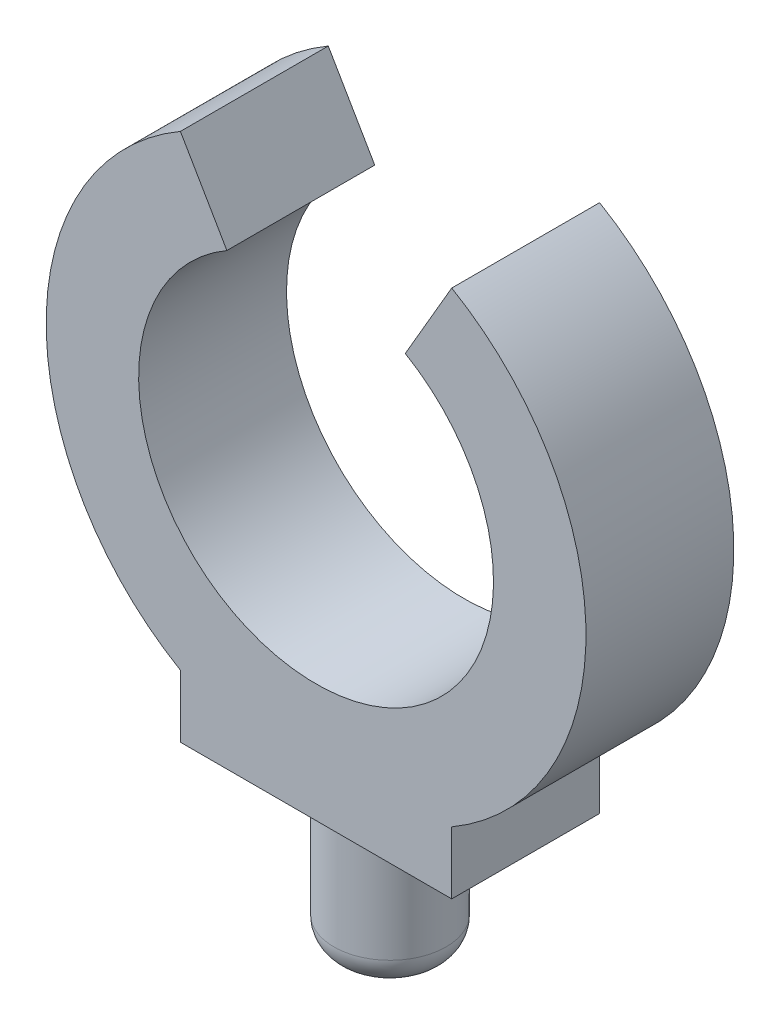
ISO-10303-21;
HEADER;
FILE_DESCRIPTION(('STEP AP214'),'2;1');
FILE_NAME('part.step','',(''),(''),'','','');
FILE_SCHEMA(('AUTOMOTIVE_DESIGN { 1 0 10303 214 1 1 1 1 }'));
ENDSEC;
DATA;
#1=APPLICATION_CONTEXT('core data for automotive mechanical design processes');
#2=APPLICATION_PROTOCOL_DEFINITION('international standard','automotive_design',2000,#1);
#3=PRODUCT_CONTEXT('',#1,'mechanical');
#4=PRODUCT('Part','Part','',(#3));
#5=PRODUCT_RELATED_PRODUCT_CATEGORY('part','',(#4));
#6=PRODUCT_DEFINITION_FORMATION('','',#4);
#7=PRODUCT_DEFINITION_CONTEXT('part definition',#1,'design');
#8=PRODUCT_DEFINITION('design','',#6,#7);
#9=PRODUCT_DEFINITION_SHAPE('','',#8);
#10=(LENGTH_UNIT() NAMED_UNIT(*) SI_UNIT(.MILLI.,.METRE.));
#11=(NAMED_UNIT(*) PLANE_ANGLE_UNIT() SI_UNIT($,.RADIAN.));
#12=(NAMED_UNIT(*) SI_UNIT($,.STERADIAN.) SOLID_ANGLE_UNIT());
#13=UNCERTAINTY_MEASURE_WITH_UNIT(LENGTH_MEASURE(1.E-05),#10,'distance_accuracy_value','');
#14=(GEOMETRIC_REPRESENTATION_CONTEXT(3) GLOBAL_UNCERTAINTY_ASSIGNED_CONTEXT((#13)) GLOBAL_UNIT_ASSIGNED_CONTEXT((#10,
#11,#12)) REPRESENTATION_CONTEXT('',''));
#15=CARTESIAN_POINT('',(0.,0.,0.));
#16=DIRECTION('',(0.,0.,1.));
#17=DIRECTION('',(1.,0.,0.));
#18=AXIS2_PLACEMENT_3D('',#15,#16,#17);
#19=CARTESIAN_POINT('',(4.5877767336432,0.,5.));
#20=DIRECTION('',(1.,0.,0.));
#21=DIRECTION('',(0.,1.,0.));
#22=AXIS2_PLACEMENT_3D('',#19,#20,#21);
#23=PLANE('',#22);
#24=DIRECTION('',(0.,-1.,0.));
#25=VECTOR('',#24,1.);
#26=CARTESIAN_POINT('',(4.5877767336432,0.,0.));
#27=LINE('',#26,#25);
#28=CARTESIAN_POINT('',(4.58777673364321,-7.88962854032071,0.));
#29=VERTEX_POINT('',#28);
#30=CARTESIAN_POINT('',(4.58777673364321,-10.,0.));
#31=VERTEX_POINT('',#30);
#32=EDGE_CURVE('E132',#29,#31,#27,.T.);
#33=ORIENTED_EDGE('',*,*,#32,.F.);
#34=DIRECTION('',(0.,0.,-1.));
#35=VECTOR('',#34,1.);
#36=CARTESIAN_POINT('',(4.58777673364321,-7.88962854032071,5.));
#37=LINE('',#36,#35);
#38=CARTESIAN_POINT('',(4.58777673364321,-7.88962854032071,5.));
#39=VERTEX_POINT('',#38);
#40=EDGE_CURVE('E94',#39,#29,#37,.T.);
#41=ORIENTED_EDGE('',*,*,#40,.F.);
#42=DIRECTION('',(0.,-1.,0.));
#43=VECTOR('',#42,1.);
#44=CARTESIAN_POINT('',(4.5877767336432,0.,5.));
#45=LINE('',#44,#43);
#46=CARTESIAN_POINT('',(4.58777673364321,-10.,5.));
#47=VERTEX_POINT('',#46);
#48=EDGE_CURVE('E152',#39,#47,#45,.T.);
#49=ORIENTED_EDGE('',*,*,#48,.T.);
#50=DIRECTION('',(0.,0.,-1.));
#51=VECTOR('',#50,1.);
#52=CARTESIAN_POINT('',(4.58777673364321,-10.,5.));
#53=LINE('',#52,#51);
#54=EDGE_CURVE('E89',#47,#31,#53,.T.);
#55=ORIENTED_EDGE('',*,*,#54,.T.);
#56=EDGE_LOOP('',(#33,#41,#49,#55));
#57=FACE_BOUND('',#56,.T.);
#58=ADVANCED_FACE('F36',(#57),#23,.T.);
#59=CARTESIAN_POINT('',(0.,0.,5.));
#60=DIRECTION('',(0.,0.,-1.));
#61=DIRECTION('',(-1.,0.,0.));
#62=AXIS2_PLACEMENT_3D('',#59,#60,#61);
#63=CYLINDRICAL_SURFACE('',#62,9.12655103870028);
#64=CARTESIAN_POINT('',(0.,0.,0.));
#65=DIRECTION('',(0.,0.,1.));
#66=DIRECTION('',(1.,0.,0.));
#67=AXIS2_PLACEMENT_3D('',#64,#65,#66);
#68=CIRCLE('',#67,9.12655103870028);
#69=CARTESIAN_POINT('',(4.58777673364321,7.88962854032071,0.));
#70=VERTEX_POINT('',#69);
#71=EDGE_CURVE('E135',#29,#70,#68,.T.);
#72=ORIENTED_EDGE('',*,*,#71,.T.);
#73=DIRECTION('',(0.,0.,-1.));
#74=VECTOR('',#73,1.);
#75=CARTESIAN_POINT('',(4.58777673364321,7.88962854032071,5.));
#76=LINE('',#75,#74);
#77=CARTESIAN_POINT('',(4.58777673364321,7.88962854032071,5.));
#78=VERTEX_POINT('',#77);
#79=EDGE_CURVE('E160',#78,#70,#76,.T.);
#80=ORIENTED_EDGE('',*,*,#79,.F.);
#81=CARTESIAN_POINT('',(0.,0.,5.));
#82=DIRECTION('',(0.,0.,1.));
#83=DIRECTION('',(1.,0.,0.));
#84=AXIS2_PLACEMENT_3D('',#81,#82,#83);
#85=CIRCLE('',#84,9.12655103870028);
#86=EDGE_CURVE('E293',#39,#78,#85,.T.);
#87=ORIENTED_EDGE('',*,*,#86,.F.);
#88=ORIENTED_EDGE('',*,*,#40,.T.);
#89=EDGE_LOOP('',(#72,#80,#87,#88));
#90=FACE_BOUND('',#89,.T.);
#91=ADVANCED_FACE('F180',(#90),#63,.T.);
#92=CARTESIAN_POINT('',(0.,0.,5.));
#93=DIRECTION('',(-0.864469886473597,0.502684608258824,0.));
#94=DIRECTION('',(-0.502684608258824,-0.864469886473597,0.));
#95=AXIS2_PLACEMENT_3D('',#92,#93,#94);
#96=PLANE('',#95);
#97=DIRECTION('',(0.502684608258824,0.864469886473597,0.));
#98=VECTOR('',#97,1.);
#99=CARTESIAN_POINT('',(0.,0.,0.));
#100=LINE('',#99,#98);
#101=CARTESIAN_POINT('',(3.01610764955294,5.18681931884158,0.));
#102=VERTEX_POINT('',#101);
#103=EDGE_CURVE('E139',#102,#70,#100,.T.);
#104=ORIENTED_EDGE('',*,*,#103,.F.);
#105=DIRECTION('',(0.,0.,-1.));
#106=VECTOR('',#105,1.);
#107=CARTESIAN_POINT('',(3.01610764955294,5.18681931884158,5.));
#108=LINE('',#107,#106);
#109=CARTESIAN_POINT('',(3.01610764955294,5.18681931884158,5.));
#110=VERTEX_POINT('',#109);
#111=EDGE_CURVE('E158',#110,#102,#108,.T.);
#112=ORIENTED_EDGE('',*,*,#111,.F.);
#113=DIRECTION('',(0.502684608258824,0.864469886473597,0.));
#114=VECTOR('',#113,1.);
#115=CARTESIAN_POINT('',(0.,0.,5.));
#116=LINE('',#115,#114);
#117=EDGE_CURVE('E295',#110,#78,#116,.T.);
#118=ORIENTED_EDGE('',*,*,#117,.T.);
#119=ORIENTED_EDGE('',*,*,#79,.T.);
#120=EDGE_LOOP('',(#104,#112,#118,#119));
#121=FACE_BOUND('',#120,.T.);
#122=ADVANCED_FACE('F184',(#121),#96,.T.);
#123=CARTESIAN_POINT('',(0.,0.,5.));
#124=DIRECTION('',(0.,0.,-1.));
#125=DIRECTION('',(-1.,0.,0.));
#126=AXIS2_PLACEMENT_3D('',#123,#124,#125);
#127=CYLINDRICAL_SURFACE('',#126,6.);
#128=CARTESIAN_POINT('',(0.,0.,0.));
#129=DIRECTION('',(0.,0.,1.));
#130=DIRECTION('',(1.,0.,0.));
#131=AXIS2_PLACEMENT_3D('',#128,#129,#130);
#132=CIRCLE('',#131,6.);
#133=CARTESIAN_POINT('',(-3.01610764955294,5.18681931884158,0.));
#134=VERTEX_POINT('',#133);
#135=EDGE_CURVE('E142',#134,#102,#132,.T.);
#136=ORIENTED_EDGE('',*,*,#135,.F.);
#137=DIRECTION('',(0.,0.,-1.));
#138=VECTOR('',#137,1.);
#139=CARTESIAN_POINT('',(-3.01610764955294,5.18681931884158,5.));
#140=LINE('',#139,#138);
#141=CARTESIAN_POINT('',(-3.01610764955294,5.18681931884158,5.));
#142=VERTEX_POINT('',#141);
#143=EDGE_CURVE('E156',#142,#134,#140,.T.);
#144=ORIENTED_EDGE('',*,*,#143,.F.);
#145=CARTESIAN_POINT('',(0.,0.,5.));
#146=DIRECTION('',(0.,0.,1.));
#147=DIRECTION('',(1.,0.,0.));
#148=AXIS2_PLACEMENT_3D('',#145,#146,#147);
#149=CIRCLE('',#148,6.);
#150=EDGE_CURVE('E301',#142,#110,#149,.T.);
#151=ORIENTED_EDGE('',*,*,#150,.T.);
#152=ORIENTED_EDGE('',*,*,#111,.T.);
#153=EDGE_LOOP('',(#136,#144,#151,#152));
#154=FACE_BOUND('',#153,.T.);
#155=ADVANCED_FACE('F190',(#154),#127,.F.);
#156=CARTESIAN_POINT('',(0.,0.,5.));
#157=DIRECTION('',(0.864469886473597,0.502684608258824,0.));
#158=DIRECTION('',(-0.502684608258824,0.864469886473597,0.));
#159=AXIS2_PLACEMENT_3D('',#156,#157,#158);
#160=PLANE('',#159);
#161=DIRECTION('',(0.502684608258824,-0.864469886473597,0.));
#162=VECTOR('',#161,1.);
#163=CARTESIAN_POINT('',(0.,0.,0.));
#164=LINE('',#163,#162);
#165=CARTESIAN_POINT('',(-4.58777673364321,7.88962854032071,0.));
#166=VERTEX_POINT('',#165);
#167=EDGE_CURVE('E145',#166,#134,#164,.T.);
#168=ORIENTED_EDGE('',*,*,#167,.F.);
#169=DIRECTION('',(0.,0.,-1.));
#170=VECTOR('',#169,1.);
#171=CARTESIAN_POINT('',(-4.58777673364321,7.88962854032071,5.));
#172=LINE('',#171,#170);
#173=CARTESIAN_POINT('',(-4.58777673364321,7.88962854032071,5.));
#174=VERTEX_POINT('',#173);
#175=EDGE_CURVE('E124',#174,#166,#172,.T.);
#176=ORIENTED_EDGE('',*,*,#175,.F.);
#177=DIRECTION('',(0.502684608258824,-0.864469886473597,0.));
#178=VECTOR('',#177,1.);
#179=CARTESIAN_POINT('',(0.,0.,5.));
#180=LINE('',#179,#178);
#181=EDGE_CURVE('E117',#174,#142,#180,.T.);
#182=ORIENTED_EDGE('',*,*,#181,.T.);
#183=ORIENTED_EDGE('',*,*,#143,.T.);
#184=EDGE_LOOP('',(#168,#176,#182,#183));
#185=FACE_BOUND('',#184,.T.);
#186=ADVANCED_FACE('F194',(#185),#160,.T.);
#187=CARTESIAN_POINT('',(0.,0.,5.));
#188=DIRECTION('',(0.,0.,-1.));
#189=DIRECTION('',(-1.,0.,0.));
#190=AXIS2_PLACEMENT_3D('',#187,#188,#189);
#191=CYLINDRICAL_SURFACE('',#190,9.12655103870028);
#192=CARTESIAN_POINT('',(0.,0.,0.));
#193=DIRECTION('',(0.,0.,1.));
#194=DIRECTION('',(1.,0.,0.));
#195=AXIS2_PLACEMENT_3D('',#192,#193,#194);
#196=CIRCLE('',#195,9.12655103870028);
#197=CARTESIAN_POINT('',(-4.58777673364321,-7.88962854032071,0.));
#198=VERTEX_POINT('',#197);
#199=EDGE_CURVE('E123',#166,#198,#196,.T.);
#200=ORIENTED_EDGE('',*,*,#199,.T.);
#201=DIRECTION('',(0.,0.,-1.));
#202=VECTOR('',#201,1.);
#203=CARTESIAN_POINT('',(-4.58777673364321,-7.88962854032071,5.));
#204=LINE('',#203,#202);
#205=CARTESIAN_POINT('',(-4.58777673364321,-7.88962854032071,5.));
#206=VERTEX_POINT('',#205);
#207=EDGE_CURVE('E120',#206,#198,#204,.T.);
#208=ORIENTED_EDGE('',*,*,#207,.F.);
#209=CARTESIAN_POINT('',(0.,0.,5.));
#210=DIRECTION('',(0.,0.,1.));
#211=DIRECTION('',(1.,0.,0.));
#212=AXIS2_PLACEMENT_3D('',#209,#210,#211);
#213=CIRCLE('',#212,9.12655103870028);
#214=EDGE_CURVE('E110',#174,#206,#213,.T.);
#215=ORIENTED_EDGE('',*,*,#214,.F.);
#216=ORIENTED_EDGE('',*,*,#175,.T.);
#217=EDGE_LOOP('',(#200,#208,#215,#216));
#218=FACE_BOUND('',#217,.T.);
#219=ADVANCED_FACE('F121',(#218),#191,.T.);
#220=CARTESIAN_POINT('',(-4.58777673364321,0.,5.));
#221=DIRECTION('',(1.,0.,0.));
#222=DIRECTION('',(0.,0.,-1.));
#223=AXIS2_PLACEMENT_3D('',#220,#221,#222);
#224=PLANE('',#223);
#225=DIRECTION('',(0.,-1.,0.));
#226=VECTOR('',#225,1.);
#227=CARTESIAN_POINT('',(-4.58777673364321,0.,0.));
#228=LINE('',#227,#226);
#229=CARTESIAN_POINT('',(-4.58777673364321,-10.,0.));
#230=VERTEX_POINT('',#229);
#231=EDGE_CURVE('E82',#198,#230,#228,.T.);
#232=ORIENTED_EDGE('',*,*,#231,.T.);
#233=DIRECTION('',(0.,0.,-1.));
#234=VECTOR('',#233,1.);
#235=CARTESIAN_POINT('',(-4.58777673364321,-10.,5.));
#236=LINE('',#235,#234);
#237=CARTESIAN_POINT('',(-4.58777673364321,-10.,5.));
#238=VERTEX_POINT('',#237);
#239=EDGE_CURVE('E125',#238,#230,#236,.T.);
#240=ORIENTED_EDGE('',*,*,#239,.F.);
#241=DIRECTION('',(0.,-1.,0.));
#242=VECTOR('',#241,1.);
#243=CARTESIAN_POINT('',(-4.58777673364321,0.,5.));
#244=LINE('',#243,#242);
#245=EDGE_CURVE('E114',#206,#238,#244,.T.);
#246=ORIENTED_EDGE('',*,*,#245,.F.);
#247=ORIENTED_EDGE('',*,*,#207,.T.);
#248=EDGE_LOOP('',(#232,#240,#246,#247));
#249=FACE_BOUND('',#248,.T.);
#250=ADVANCED_FACE('F127',(#249),#224,.F.);
#251=CARTESIAN_POINT('',(0.,-10.,5.));
#252=DIRECTION('',(0.,1.,0.));
#253=DIRECTION('',(0.,0.,1.));
#254=AXIS2_PLACEMENT_3D('',#251,#252,#253);
#255=PLANE('',#254);
#256=CARTESIAN_POINT('',(0.,-10.,2.5));
#257=DIRECTION('',(0.,-1.,0.));
#258=DIRECTION('',(0.,0.,-1.));
#259=AXIS2_PLACEMENT_3D('',#256,#257,#258);
#260=CIRCLE('',#259,1.9);
#261=CARTESIAN_POINT('',(0.,-10.,0.599999999999999));
#262=VERTEX_POINT('',#261);
#263=EDGE_CURVE('E136',#262,#262,#260,.T.);
#264=ORIENTED_EDGE('',*,*,#263,.F.);
#265=EDGE_LOOP('',(#264));
#266=FACE_BOUND('',#265,.T.);
#267=DIRECTION('',(1.,0.,0.));
#268=VECTOR('',#267,1.);
#269=CARTESIAN_POINT('',(0.,-10.,0.));
#270=LINE('',#269,#268);
#271=EDGE_CURVE('E150',#230,#31,#270,.T.);
#272=ORIENTED_EDGE('',*,*,#271,.T.);
#273=ORIENTED_EDGE('',*,*,#54,.F.);
#274=DIRECTION('',(1.,0.,0.));
#275=VECTOR('',#274,1.);
#276=CARTESIAN_POINT('',(0.,-10.,5.));
#277=LINE('',#276,#275);
#278=EDGE_CURVE('E53',#238,#47,#277,.T.);
#279=ORIENTED_EDGE('',*,*,#278,.F.);
#280=ORIENTED_EDGE('',*,*,#239,.T.);
#281=EDGE_LOOP('',(#272,#273,#279,#280));
#282=FACE_BOUND('',#281,.T.);
#283=ADVANCED_FACE('F203',(#266,#282),#255,.F.);
#284=CARTESIAN_POINT('',(0.,0.,5.));
#285=DIRECTION('',(0.,0.,1.));
#286=DIRECTION('',(1.,0.,0.));
#287=AXIS2_PLACEMENT_3D('',#284,#285,#286);
#288=PLANE('',#287);
#289=ORIENTED_EDGE('',*,*,#48,.F.);
#290=ORIENTED_EDGE('',*,*,#86,.T.);
#291=ORIENTED_EDGE('',*,*,#117,.F.);
#292=ORIENTED_EDGE('',*,*,#150,.F.);
#293=ORIENTED_EDGE('',*,*,#181,.F.);
#294=ORIENTED_EDGE('',*,*,#214,.T.);
#295=ORIENTED_EDGE('',*,*,#245,.T.);
#296=ORIENTED_EDGE('',*,*,#278,.T.);
#297=EDGE_LOOP('',(#289,#290,#291,#292,#293,#294,#295,#296));
#298=FACE_BOUND('',#297,.T.);
#299=ADVANCED_FACE('F112',(#298),#288,.T.);
#300=CARTESIAN_POINT('',(0.,0.,0.));
#301=DIRECTION('',(0.,0.,1.));
#302=DIRECTION('',(1.,0.,0.));
#303=AXIS2_PLACEMENT_3D('',#300,#301,#302);
#304=PLANE('',#303);
#305=ORIENTED_EDGE('',*,*,#32,.T.);
#306=ORIENTED_EDGE('',*,*,#271,.F.);
#307=ORIENTED_EDGE('',*,*,#231,.F.);
#308=ORIENTED_EDGE('',*,*,#199,.F.);
#309=ORIENTED_EDGE('',*,*,#167,.T.);
#310=ORIENTED_EDGE('',*,*,#135,.T.);
#311=ORIENTED_EDGE('',*,*,#103,.T.);
#312=ORIENTED_EDGE('',*,*,#71,.F.);
#313=EDGE_LOOP('',(#305,#306,#307,#308,#309,#310,#311,#312));
#314=FACE_BOUND('',#313,.T.);
#315=ADVANCED_FACE('F175',(#314),#304,.F.);
#316=CARTESIAN_POINT('',(0.,-15.,0.));
#317=DIRECTION('',(0.,-1.,0.));
#318=DIRECTION('',(0.,0.,-1.));
#319=AXIS2_PLACEMENT_3D('',#316,#317,#318);
#320=PLANE('',#319);
#321=CARTESIAN_POINT('',(0.,-15.,2.5));
#322=DIRECTION('',(0.,-1.,0.));
#323=DIRECTION('',(0.,0.,-1.));
#324=AXIS2_PLACEMENT_3D('',#321,#322,#323);
#325=CIRCLE('',#324,0.9);
#326=CARTESIAN_POINT('',(0.,-15.,1.6));
#327=VERTEX_POINT('',#326);
#328=EDGE_CURVE('E45',#327,#327,#325,.T.);
#329=ORIENTED_EDGE('',*,*,#328,.T.);
#330=EDGE_LOOP('',(#329));
#331=FACE_BOUND('',#330,.T.);
#332=ADVANCED_FACE('F165',(#331),#320,.T.);
#333=CARTESIAN_POINT('',(0.,-10.,2.5));
#334=DIRECTION('',(0.,-1.,0.));
#335=DIRECTION('',(0.,0.,-1.));
#336=AXIS2_PLACEMENT_3D('',#333,#334,#335);
#337=CYLINDRICAL_SURFACE('',#336,1.9);
#338=CARTESIAN_POINT('',(0.,-14.,2.5));
#339=DIRECTION('',(0.,-1.,0.));
#340=DIRECTION('',(0.,0.,-1.));
#341=AXIS2_PLACEMENT_3D('',#338,#339,#340);
#342=CIRCLE('',#341,1.9);
#343=CARTESIAN_POINT('',(0.,-14.,0.599999999999999));
#344=VERTEX_POINT('',#343);
#345=EDGE_CURVE('E12',#344,#344,#342,.F.);
#346=ORIENTED_EDGE('',*,*,#345,.T.);
#347=EDGE_LOOP('',(#346));
#348=FACE_BOUND('',#347,.T.);
#349=ORIENTED_EDGE('',*,*,#263,.T.);
#350=EDGE_LOOP('',(#349));
#351=FACE_BOUND('',#350,.T.);
#352=ADVANCED_FACE('F168',(#348,#351),#337,.T.);
#353=CARTESIAN_POINT('',(0.,-14.,2.5));
#354=DIRECTION('',(0.,-1.,0.));
#355=DIRECTION('',(0.,0.,-1.));
#356=AXIS2_PLACEMENT_3D('',#353,#354,#355);
#357=DEGENERATE_TOROIDAL_SURFACE('',#356,0.9,1.,.T.);
#358=ORIENTED_EDGE('',*,*,#345,.F.);
#359=EDGE_LOOP('',(#358));
#360=FACE_BOUND('',#359,.T.);
#361=ORIENTED_EDGE('',*,*,#328,.F.);
#362=EDGE_LOOP('',(#361));
#363=FACE_BOUND('',#362,.T.);
#364=ADVANCED_FACE('F38',(#360,#363),#357,.T.);
#365=CLOSED_SHELL('',(#58,#91,#122,#155,#186,#219,#250,#283,#299,#315,#332,#352,#364));
#366=MANIFOLD_SOLID_BREP('B2',#365);
#367=ADVANCED_BREP_SHAPE_REPRESENTATION('',(#18,#366),#14);
#368=SHAPE_DEFINITION_REPRESENTATION(#9,#367);
ENDSEC;
END-ISO-10303-21;
